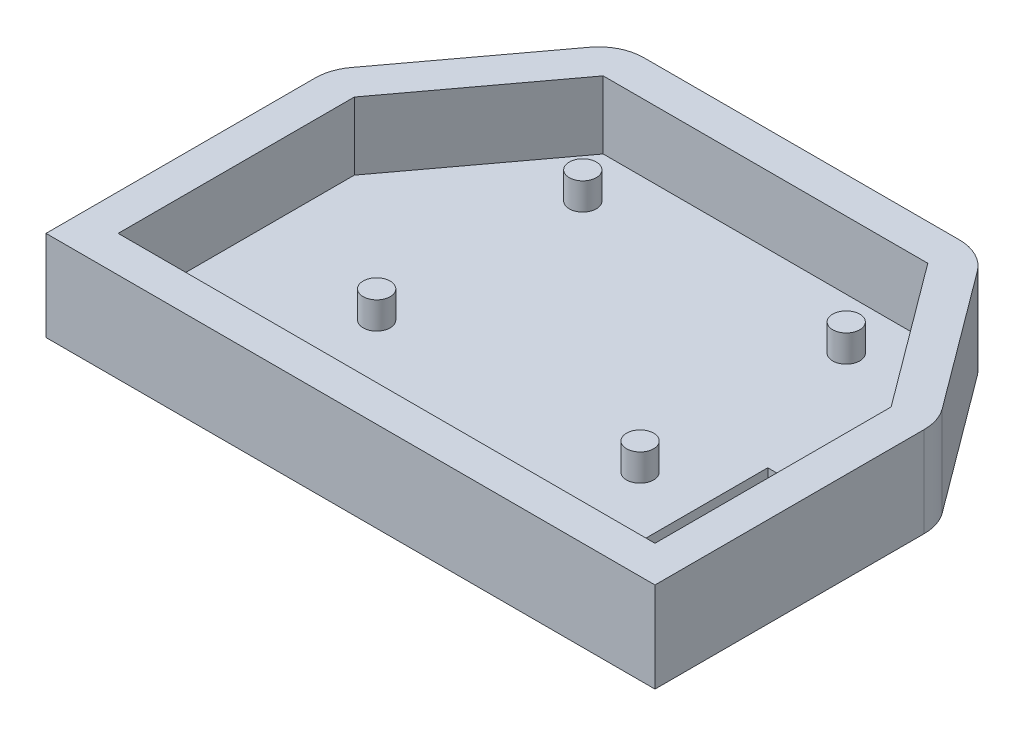
ISO-10303-21;
HEADER;
FILE_DESCRIPTION(('STEP AP214'),'2;1');
FILE_NAME('part.step','',(''),(''),'','','');
FILE_SCHEMA(('AUTOMOTIVE_DESIGN { 1 0 10303 214 1 1 1 1 }'));
ENDSEC;
DATA;
#1=APPLICATION_CONTEXT('core data for automotive mechanical design processes');
#2=APPLICATION_PROTOCOL_DEFINITION('international standard','automotive_design',2000,#1);
#3=PRODUCT_CONTEXT('',#1,'mechanical');
#4=PRODUCT('Part','Part','',(#3));
#5=PRODUCT_RELATED_PRODUCT_CATEGORY('part','',(#4));
#6=PRODUCT_DEFINITION_FORMATION('','',#4);
#7=PRODUCT_DEFINITION_CONTEXT('part definition',#1,'design');
#8=PRODUCT_DEFINITION('design','',#6,#7);
#9=PRODUCT_DEFINITION_SHAPE('','',#8);
#10=(LENGTH_UNIT() NAMED_UNIT(*) SI_UNIT(.MILLI.,.METRE.));
#11=(NAMED_UNIT(*) PLANE_ANGLE_UNIT() SI_UNIT($,.RADIAN.));
#12=(NAMED_UNIT(*) SI_UNIT($,.STERADIAN.) SOLID_ANGLE_UNIT());
#13=UNCERTAINTY_MEASURE_WITH_UNIT(LENGTH_MEASURE(1.E-05),#10,'distance_accuracy_value','');
#14=(GEOMETRIC_REPRESENTATION_CONTEXT(3) GLOBAL_UNCERTAINTY_ASSIGNED_CONTEXT((#13)) GLOBAL_UNIT_ASSIGNED_CONTEXT((#10,
#11,#12)) REPRESENTATION_CONTEXT('',''));
#15=CARTESIAN_POINT('',(0.,0.,0.));
#16=DIRECTION('',(0.,0.,1.));
#17=DIRECTION('',(1.,0.,0.));
#18=AXIS2_PLACEMENT_3D('',#15,#16,#17);
#19=CARTESIAN_POINT('',(-37.3370264976293,83.5,-23.1323962318236));
#20=DIRECTION('',(0.,-1.,0.));
#21=DIRECTION('',(-1.,0.,0.));
#22=AXIS2_PLACEMENT_3D('',#19,#20,#21);
#23=CYLINDRICAL_SURFACE('',#22,10.0000000000001);
#24=DIRECTION('',(0.,-1.,0.));
#25=VECTOR('',#24,1.);
#26=CARTESIAN_POINT('',(-29.3110716594445,83.5,-29.0976329358799));
#27=LINE('',#26,#25);
#28=CARTESIAN_POINT('',(-29.3110716594445,83.5,-29.0976329358799));
#29=VERTEX_POINT('',#28);
#30=CARTESIAN_POINT('',(-29.3110716594446,63.5,-29.0976329358799));
#31=VERTEX_POINT('',#30);
#32=EDGE_CURVE('E313',#29,#31,#27,.T.);
#33=ORIENTED_EDGE('',*,*,#32,.T.);
#34=CARTESIAN_POINT('',(-37.3370264976293,63.5,-23.1323962318236));
#35=DIRECTION('',(0.,1.,0.));
#36=DIRECTION('',(-1.,0.,0.));
#37=AXIS2_PLACEMENT_3D('',#34,#35,#36);
#38=CIRCLE('',#37,10.0000000000001);
#39=CARTESIAN_POINT('',(-37.3370264976293,63.5,-33.1323962318237));
#40=VERTEX_POINT('',#39);
#41=EDGE_CURVE('E235',#31,#40,#38,.T.);
#42=ORIENTED_EDGE('',*,*,#41,.T.);
#43=DIRECTION('',(0.,-1.,0.));
#44=VECTOR('',#43,1.);
#45=CARTESIAN_POINT('',(-37.3370264976293,83.5,-33.1323962318237));
#46=LINE('',#45,#44);
#47=CARTESIAN_POINT('',(-37.3370264976293,83.5,-33.1323962318237));
#48=VERTEX_POINT('',#47);
#49=EDGE_CURVE('E11',#48,#40,#46,.T.);
#50=ORIENTED_EDGE('',*,*,#49,.F.);
#51=CARTESIAN_POINT('',(-37.3370264976293,83.5,-23.1323962318236));
#52=DIRECTION('',(0.,1.,0.));
#53=DIRECTION('',(1.,0.,0.));
#54=AXIS2_PLACEMENT_3D('',#51,#52,#53);
#55=CIRCLE('',#54,10.0000000000001);
#56=EDGE_CURVE('E278',#29,#48,#55,.T.);
#57=ORIENTED_EDGE('',*,*,#56,.F.);
#58=EDGE_LOOP('',(#33,#42,#50,#57));
#59=FACE_BOUND('',#58,.T.);
#60=ADVANCED_FACE('F41',(#59),#23,.T.);
#61=CARTESIAN_POINT('',(0.,83.5,-33.1323962318237));
#62=DIRECTION('',(0.,0.,1.));
#63=DIRECTION('',(0.,-1.,0.));
#64=AXIS2_PLACEMENT_3D('',#61,#62,#63);
#65=PLANE('',#64);
#66=ORIENTED_EDGE('',*,*,#49,.T.);
#67=DIRECTION('',(-1.,0.,0.));
#68=VECTOR('',#67,1.);
#69=CARTESIAN_POINT('',(-107.282737936852,63.5,-33.1323962318237));
#70=LINE('',#69,#68);
#71=CARTESIAN_POINT('',(-107.282737936852,63.5,-33.1323962318237));
#72=VERTEX_POINT('',#71);
#73=EDGE_CURVE('E238',#40,#72,#70,.T.);
#74=ORIENTED_EDGE('',*,*,#73,.T.);
#75=DIRECTION('',(0.,-1.,0.));
#76=VECTOR('',#75,1.);
#77=CARTESIAN_POINT('',(-107.282737936852,83.5,-33.1323962318237));
#78=LINE('',#77,#76);
#79=CARTESIAN_POINT('',(-107.282737936852,83.5,-33.1323962318237));
#80=VERTEX_POINT('',#79);
#81=EDGE_CURVE('E51',#80,#72,#78,.T.);
#82=ORIENTED_EDGE('',*,*,#81,.F.);
#83=DIRECTION('',(-1.,0.,0.));
#84=VECTOR('',#83,1.);
#85=CARTESIAN_POINT('',(0.,83.5,-33.1323962318237));
#86=LINE('',#85,#84);
#87=EDGE_CURVE('E280',#48,#80,#86,.T.);
#88=ORIENTED_EDGE('',*,*,#87,.F.);
#89=EDGE_LOOP('',(#66,#74,#82,#88));
#90=FACE_BOUND('',#89,.T.);
#91=ADVANCED_FACE('F379',(#90),#65,.F.);
#92=CARTESIAN_POINT('',(-107.282737936852,83.5,-23.1323962318235));
#93=DIRECTION('',(0.,-1.,0.));
#94=DIRECTION('',(-1.,0.,0.));
#95=AXIS2_PLACEMENT_3D('',#92,#93,#94);
#96=CYLINDRICAL_SURFACE('',#95,10.0000000000002);
#97=ORIENTED_EDGE('',*,*,#81,.T.);
#98=CARTESIAN_POINT('',(-107.282737936852,63.5,-23.1323962318235));
#99=DIRECTION('',(0.,1.,0.));
#100=DIRECTION('',(-1.,0.,0.));
#101=AXIS2_PLACEMENT_3D('',#98,#99,#100);
#102=CIRCLE('',#101,10.0000000000002);
#103=CARTESIAN_POINT('',(-115.308692775037,63.5,-29.0976329358799));
#104=VERTEX_POINT('',#103);
#105=EDGE_CURVE('E241',#72,#104,#102,.T.);
#106=ORIENTED_EDGE('',*,*,#105,.T.);
#107=DIRECTION('',(0.,-1.,0.));
#108=VECTOR('',#107,1.);
#109=CARTESIAN_POINT('',(-115.308692775037,83.5,-29.0976329358799));
#110=LINE('',#109,#108);
#111=CARTESIAN_POINT('',(-115.308692775037,83.5,-29.0976329358799));
#112=VERTEX_POINT('',#111);
#113=EDGE_CURVE('E327',#112,#104,#110,.T.);
#114=ORIENTED_EDGE('',*,*,#113,.F.);
#115=CARTESIAN_POINT('',(-107.282737936852,83.5,-23.1323962318235));
#116=DIRECTION('',(0.,1.,0.));
#117=DIRECTION('',(1.,0.,0.));
#118=AXIS2_PLACEMENT_3D('',#115,#116,#117);
#119=CIRCLE('',#118,10.0000000000002);
#120=EDGE_CURVE('E282',#80,#112,#119,.T.);
#121=ORIENTED_EDGE('',*,*,#120,.F.);
#122=EDGE_LOOP('',(#97,#106,#114,#121));
#123=FACE_BOUND('',#122,.T.);
#124=ADVANCED_FACE('F384',(#123),#96,.T.);
#125=CARTESIAN_POINT('',(-88.2081834707837,83.5,-65.5601363634203));
#126=DIRECTION('',(0.802595483818471,0.,0.596523670405621));
#127=DIRECTION('',(0.596523670405621,0.,-0.802595483818471));
#128=AXIS2_PLACEMENT_3D('',#125,#126,#127);
#129=PLANE('',#128);
#130=ORIENTED_EDGE('',*,*,#113,.T.);
#131=DIRECTION('',(-0.596523670405621,0.,0.802595483818471));
#132=VECTOR('',#131,1.);
#133=CARTESIAN_POINT('',(-115.308692775037,63.5,-29.0976329358799));
#134=LINE('',#133,#132);
#135=CARTESIAN_POINT('',(-137.835837055425,63.5,1.21161573227939));
#136=VERTEX_POINT('',#135);
#137=EDGE_CURVE('E244',#104,#136,#134,.T.);
#138=ORIENTED_EDGE('',*,*,#137,.T.);
#139=DIRECTION('',(0.,-1.,0.));
#140=VECTOR('',#139,1.);
#141=CARTESIAN_POINT('',(-137.835837055425,83.5,1.21161573227939));
#142=LINE('',#141,#140);
#143=CARTESIAN_POINT('',(-137.835837055425,83.5,1.21161573227939));
#144=VERTEX_POINT('',#143);
#145=EDGE_CURVE('E325',#144,#136,#142,.T.);
#146=ORIENTED_EDGE('',*,*,#145,.F.);
#147=DIRECTION('',(-0.596523670405621,0.,0.802595483818471));
#148=VECTOR('',#147,1.);
#149=CARTESIAN_POINT('',(-88.2081834707837,83.5,-65.5601363634203));
#150=LINE('',#149,#148);
#151=EDGE_CURVE('E284',#112,#144,#150,.T.);
#152=ORIENTED_EDGE('',*,*,#151,.F.);
#153=EDGE_LOOP('',(#130,#138,#146,#152));
#154=FACE_BOUND('',#153,.T.);
#155=ADVANCED_FACE('F390',(#154),#129,.F.);
#156=CARTESIAN_POINT('',(-129.80988221724,83.5,7.17685243633568));
#157=DIRECTION('',(0.,-1.,0.));
#158=DIRECTION('',(-1.,0.,0.));
#159=AXIS2_PLACEMENT_3D('',#156,#157,#158);
#160=CYLINDRICAL_SURFACE('',#159,10.0000000000003);
#161=ORIENTED_EDGE('',*,*,#145,.T.);
#162=CARTESIAN_POINT('',(-129.80988221724,63.5,7.17685243633568));
#163=DIRECTION('',(0.,1.,0.));
#164=DIRECTION('',(-1.,0.,0.));
#165=AXIS2_PLACEMENT_3D('',#162,#163,#164);
#166=CIRCLE('',#165,10.0000000000003);
#167=CARTESIAN_POINT('',(-139.809882217241,63.5,7.17685243633561));
#168=VERTEX_POINT('',#167);
#169=EDGE_CURVE('E247',#136,#168,#166,.T.);
#170=ORIENTED_EDGE('',*,*,#169,.T.);
#171=DIRECTION('',(0.,-1.,0.));
#172=VECTOR('',#171,1.);
#173=CARTESIAN_POINT('',(-139.809882217241,83.5,7.17685243633561));
#174=LINE('',#173,#172);
#175=CARTESIAN_POINT('',(-139.809882217241,83.5,7.17685243633561));
#176=VERTEX_POINT('',#175);
#177=EDGE_CURVE('E323',#176,#168,#174,.T.);
#178=ORIENTED_EDGE('',*,*,#177,.F.);
#179=CARTESIAN_POINT('',(-129.80988221724,83.5,7.17685243633568));
#180=DIRECTION('',(0.,1.,0.));
#181=DIRECTION('',(1.,0.,0.));
#182=AXIS2_PLACEMENT_3D('',#179,#180,#181);
#183=CIRCLE('',#182,10.0000000000003);
#184=EDGE_CURVE('E286',#144,#176,#183,.T.);
#185=ORIENTED_EDGE('',*,*,#184,.F.);
#186=EDGE_LOOP('',(#161,#170,#178,#185));
#187=FACE_BOUND('',#186,.T.);
#188=ADVANCED_FACE('F394',(#187),#160,.T.);
#189=CARTESIAN_POINT('',(-139.809882217241,83.5,0.));
#190=DIRECTION('',(1.,0.,0.));
#191=DIRECTION('',(0.,0.,-1.));
#192=AXIS2_PLACEMENT_3D('',#189,#190,#191);
#193=PLANE('',#192);
#194=ORIENTED_EDGE('',*,*,#177,.T.);
#195=DIRECTION('',(0.,0.,1.));
#196=VECTOR('',#195,1.);
#197=CARTESIAN_POINT('',(-139.809882217241,63.5,66.8676037681763));
#198=LINE('',#197,#196);
#199=CARTESIAN_POINT('',(-139.809882217241,63.5,66.8676037681763));
#200=VERTEX_POINT('',#199);
#201=EDGE_CURVE('E194',#168,#200,#198,.T.);
#202=ORIENTED_EDGE('',*,*,#201,.T.);
#203=DIRECTION('',(0.,-1.,0.));
#204=VECTOR('',#203,1.);
#205=CARTESIAN_POINT('',(-139.809882217241,83.5,66.8676037681763));
#206=LINE('',#205,#204);
#207=CARTESIAN_POINT('',(-139.809882217241,83.5,66.8676037681763));
#208=VERTEX_POINT('',#207);
#209=EDGE_CURVE('E321',#208,#200,#206,.T.);
#210=ORIENTED_EDGE('',*,*,#209,.F.);
#211=DIRECTION('',(0.,0.,1.));
#212=VECTOR('',#211,1.);
#213=CARTESIAN_POINT('',(-139.809882217241,83.5,0.));
#214=LINE('',#213,#212);
#215=EDGE_CURVE('E288',#176,#208,#214,.T.);
#216=ORIENTED_EDGE('',*,*,#215,.F.);
#217=EDGE_LOOP('',(#194,#202,#210,#216));
#218=FACE_BOUND('',#217,.T.);
#219=ADVANCED_FACE('F399',(#218),#193,.F.);
#220=CARTESIAN_POINT('',(0.,83.5,66.8676037681763));
#221=DIRECTION('',(0.,0.,-1.));
#222=DIRECTION('',(-1.,0.,0.));
#223=AXIS2_PLACEMENT_3D('',#220,#221,#222);
#224=PLANE('',#223);
#225=ORIENTED_EDGE('',*,*,#209,.T.);
#226=DIRECTION('',(1.,0.,0.));
#227=VECTOR('',#226,1.);
#228=CARTESIAN_POINT('',(-139.809882217241,63.5,66.8676037681763));
#229=LINE('',#228,#227);
#230=CARTESIAN_POINT('',(-4.8098822172406,63.5,66.8676037681763));
#231=VERTEX_POINT('',#230);
#232=EDGE_CURVE('E223',#200,#231,#229,.T.);
#233=ORIENTED_EDGE('',*,*,#232,.T.);
#234=DIRECTION('',(0.,-1.,0.));
#235=VECTOR('',#234,1.);
#236=CARTESIAN_POINT('',(-4.8098822172406,83.5,66.8676037681763));
#237=LINE('',#236,#235);
#238=CARTESIAN_POINT('',(-4.8098822172406,83.5,66.8676037681763));
#239=VERTEX_POINT('',#238);
#240=EDGE_CURVE('E319',#239,#231,#237,.T.);
#241=ORIENTED_EDGE('',*,*,#240,.F.);
#242=DIRECTION('',(1.,0.,0.));
#243=VECTOR('',#242,1.);
#244=CARTESIAN_POINT('',(0.,83.5,66.8676037681763));
#245=LINE('',#244,#243);
#246=EDGE_CURVE('E290',#208,#239,#245,.T.);
#247=ORIENTED_EDGE('',*,*,#246,.F.);
#248=EDGE_LOOP('',(#225,#233,#241,#247));
#249=FACE_BOUND('',#248,.T.);
#250=ADVANCED_FACE('F405',(#249),#224,.F.);
#251=CARTESIAN_POINT('',(-4.8098822172406,83.5,0.));
#252=DIRECTION('',(-1.,0.,0.));
#253=DIRECTION('',(0.,1.,0.));
#254=AXIS2_PLACEMENT_3D('',#251,#252,#253);
#255=PLANE('',#254);
#256=ORIENTED_EDGE('',*,*,#240,.T.);
#257=DIRECTION('',(0.,0.,-1.));
#258=VECTOR('',#257,1.);
#259=CARTESIAN_POINT('',(-4.8098822172406,63.5,66.8676037681763));
#260=LINE('',#259,#258);
#261=CARTESIAN_POINT('',(-4.8098822172406,63.5,7.1768524363356));
#262=VERTEX_POINT('',#261);
#263=EDGE_CURVE('E226',#231,#262,#260,.T.);
#264=ORIENTED_EDGE('',*,*,#263,.T.);
#265=DIRECTION('',(0.,-1.,0.));
#266=VECTOR('',#265,1.);
#267=CARTESIAN_POINT('',(-4.8098822172406,83.5,7.17685243633558));
#268=LINE('',#267,#266);
#269=CARTESIAN_POINT('',(-4.8098822172406,83.5,7.17685243633558));
#270=VERTEX_POINT('',#269);
#271=EDGE_CURVE('E317',#270,#262,#268,.T.);
#272=ORIENTED_EDGE('',*,*,#271,.F.);
#273=DIRECTION('',(0.,0.,-1.));
#274=VECTOR('',#273,1.);
#275=CARTESIAN_POINT('',(-4.8098822172406,83.5,0.));
#276=LINE('',#275,#274);
#277=EDGE_CURVE('E292',#239,#270,#276,.T.);
#278=ORIENTED_EDGE('',*,*,#277,.F.);
#279=EDGE_LOOP('',(#256,#264,#272,#278));
#280=FACE_BOUND('',#279,.T.);
#281=ADVANCED_FACE('F409',(#280),#255,.F.);
#282=CARTESIAN_POINT('',(-14.8098822172407,83.5,7.17685243633558));
#283=DIRECTION('',(0.,-1.,0.));
#284=DIRECTION('',(-1.,0.,0.));
#285=AXIS2_PLACEMENT_3D('',#282,#283,#284);
#286=CYLINDRICAL_SURFACE('',#285,10.0000000000001);
#287=ORIENTED_EDGE('',*,*,#271,.T.);
#288=CARTESIAN_POINT('',(-14.8098822172407,63.5,7.17685243633558));
#289=DIRECTION('',(0.,1.,0.));
#290=DIRECTION('',(1.,0.,0.));
#291=AXIS2_PLACEMENT_3D('',#288,#289,#290);
#292=CIRCLE('',#291,10.0000000000001);
#293=CARTESIAN_POINT('',(-6.78392737905587,63.5,1.21161573227937));
#294=VERTEX_POINT('',#293);
#295=EDGE_CURVE('E229',#262,#294,#292,.T.);
#296=ORIENTED_EDGE('',*,*,#295,.T.);
#297=DIRECTION('',(0.,-1.,0.));
#298=VECTOR('',#297,1.);
#299=CARTESIAN_POINT('',(-6.78392737905587,83.5,1.21161573227937));
#300=LINE('',#299,#298);
#301=CARTESIAN_POINT('',(-6.78392737905587,83.5,1.21161573227937));
#302=VERTEX_POINT('',#301);
#303=EDGE_CURVE('E315',#302,#294,#300,.T.);
#304=ORIENTED_EDGE('',*,*,#303,.F.);
#305=CARTESIAN_POINT('',(-14.8098822172407,83.5,7.17685243633558));
#306=DIRECTION('',(0.,1.,0.));
#307=DIRECTION('',(1.,0.,0.));
#308=AXIS2_PLACEMENT_3D('',#305,#306,#307);
#309=CIRCLE('',#308,10.0000000000001);
#310=EDGE_CURVE('E294',#270,#302,#309,.T.);
#311=ORIENTED_EDGE('',*,*,#310,.F.);
#312=EDGE_LOOP('',(#287,#296,#304,#311));
#313=FACE_BOUND('',#312,.T.);
#314=ADVANCED_FACE('F414',(#313),#286,.T.);
#315=CARTESIAN_POINT('',(0.,83.5,-25.1323962318237));
#316=DIRECTION('',(0.,0.,-1.));
#317=DIRECTION('',(-1.,0.,0.));
#318=AXIS2_PLACEMENT_3D('',#315,#316,#317);
#319=PLANE('',#318);
#320=DIRECTION('',(1.,0.,0.));
#321=VECTOR('',#320,1.);
#322=CARTESIAN_POINT('',(0.,68.5,-25.1323962318237));
#323=LINE('',#322,#321);
#324=CARTESIAN_POINT('',(-108.28816679293,68.5,-25.1323962318237));
#325=VERTEX_POINT('',#324);
#326=CARTESIAN_POINT('',(-36.3315976415515,68.5,-25.1323962318237));
#327=VERTEX_POINT('',#326);
#328=EDGE_CURVE('E262',#325,#327,#323,.T.);
#329=ORIENTED_EDGE('',*,*,#328,.T.);
#330=DIRECTION('',(0.,-1.,0.));
#331=VECTOR('',#330,1.);
#332=CARTESIAN_POINT('',(-36.3315976415515,83.5,-25.1323962318237));
#333=LINE('',#332,#331);
#334=CARTESIAN_POINT('',(-36.3315976415515,83.5,-25.1323962318237));
#335=VERTEX_POINT('',#334);
#336=EDGE_CURVE('E45',#335,#327,#333,.T.);
#337=ORIENTED_EDGE('',*,*,#336,.F.);
#338=DIRECTION('',(1.,0.,0.));
#339=VECTOR('',#338,1.);
#340=CARTESIAN_POINT('',(0.,83.5,-25.1323962318237));
#341=LINE('',#340,#339);
#342=CARTESIAN_POINT('',(-108.28816679293,83.5,-25.1323962318237));
#343=VERTEX_POINT('',#342);
#344=EDGE_CURVE('E263',#343,#335,#341,.T.);
#345=ORIENTED_EDGE('',*,*,#344,.F.);
#346=DIRECTION('',(0.,-1.,0.));
#347=VECTOR('',#346,1.);
#348=CARTESIAN_POINT('',(-108.28816679293,83.5,-25.1323962318237));
#349=LINE('',#348,#347);
#350=EDGE_CURVE('E297',#343,#325,#349,.T.);
#351=ORIENTED_EDGE('',*,*,#350,.T.);
#352=EDGE_LOOP('',(#329,#337,#345,#351));
#353=FACE_BOUND('',#352,.T.);
#354=ADVANCED_FACE('F43',(#353),#319,.F.);
#355=CARTESIAN_POINT('',(-11.3707770875913,83.5,8.45125324077732));
#356=DIRECTION('',(0.802595483818471,0.,-0.596523670405622));
#357=DIRECTION('',(-0.596523670405622,0.,-0.802595483818471));
#358=AXIS2_PLACEMENT_3D('',#355,#356,#357);
#359=PLANE('',#358);
#360=DIRECTION('',(0.596523670405622,0.,0.802595483818471));
#361=VECTOR('',#360,1.);
#362=CARTESIAN_POINT('',(-11.3707770875913,68.5,8.45125324077732));
#363=LINE('',#362,#361);
#364=CARTESIAN_POINT('',(-12.8098822172406,68.5,6.51500270270369));
#365=VERTEX_POINT('',#364);
#366=EDGE_CURVE('E300',#327,#365,#363,.T.);
#367=ORIENTED_EDGE('',*,*,#366,.T.);
#368=DIRECTION('',(0.,-1.,0.));
#369=VECTOR('',#368,1.);
#370=CARTESIAN_POINT('',(-12.8098822172406,83.5,6.51500270270369));
#371=LINE('',#370,#369);
#372=CARTESIAN_POINT('',(-12.8098822172406,83.5,6.51500270270369));
#373=VERTEX_POINT('',#372);
#374=EDGE_CURVE('E340',#373,#365,#371,.T.);
#375=ORIENTED_EDGE('',*,*,#374,.F.);
#376=DIRECTION('',(0.596523670405622,0.,0.802595483818471));
#377=VECTOR('',#376,1.);
#378=CARTESIAN_POINT('',(-11.3707770875913,83.5,8.45125324077732));
#379=LINE('',#378,#377);
#380=EDGE_CURVE('E266',#335,#373,#379,.T.);
#381=ORIENTED_EDGE('',*,*,#380,.F.);
#382=ORIENTED_EDGE('',*,*,#336,.T.);
#383=EDGE_LOOP('',(#367,#375,#381,#382));
#384=FACE_BOUND('',#383,.T.);
#385=ADVANCED_FACE('F348',(#384),#359,.F.);
#386=CARTESIAN_POINT('',(-12.8098822172406,83.5,0.));
#387=DIRECTION('',(1.,0.,0.));
#388=DIRECTION('',(0.,0.,-1.));
#389=AXIS2_PLACEMENT_3D('',#386,#387,#388);
#390=PLANE('',#389);
#391=DIRECTION('',(0.,0.,1.));
#392=VECTOR('',#391,1.);
#393=CARTESIAN_POINT('',(-12.8098822172406,68.5,0.));
#394=LINE('',#393,#392);
#395=CARTESIAN_POINT('',(-12.8098822172406,68.5,58.8676037681763));
#396=VERTEX_POINT('',#395);
#397=EDGE_CURVE('E303',#365,#396,#394,.T.);
#398=ORIENTED_EDGE('',*,*,#397,.T.);
#399=DIRECTION('',(0.,-1.,0.));
#400=VECTOR('',#399,1.);
#401=CARTESIAN_POINT('',(-12.8098822172406,83.5,58.8676037681763));
#402=LINE('',#401,#400);
#403=CARTESIAN_POINT('',(-12.8098822172406,83.5,58.8676037681763));
#404=VERTEX_POINT('',#403);
#405=EDGE_CURVE('E338',#404,#396,#402,.T.);
#406=ORIENTED_EDGE('',*,*,#405,.F.);
#407=DIRECTION('',(0.,0.,1.));
#408=VECTOR('',#407,1.);
#409=CARTESIAN_POINT('',(-12.8098822172406,83.5,0.));
#410=LINE('',#409,#408);
#411=EDGE_CURVE('E269',#373,#404,#410,.T.);
#412=ORIENTED_EDGE('',*,*,#411,.F.);
#413=ORIENTED_EDGE('',*,*,#374,.T.);
#414=EDGE_LOOP('',(#398,#406,#412,#413));
#415=FACE_BOUND('',#414,.T.);
#416=ADVANCED_FACE('F364',(#415),#390,.F.);
#417=CARTESIAN_POINT('',(0.,83.5,58.8676037681763));
#418=DIRECTION('',(0.,0.,1.));
#419=DIRECTION('',(1.,0.,0.));
#420=AXIS2_PLACEMENT_3D('',#417,#418,#419);
#421=PLANE('',#420);
#422=DIRECTION('',(-1.,0.,0.));
#423=VECTOR('',#422,1.);
#424=CARTESIAN_POINT('',(0.,68.5,58.8676037681763));
#425=LINE('',#424,#423);
#426=CARTESIAN_POINT('',(-131.809882217241,68.5,58.8676037681763));
#427=VERTEX_POINT('',#426);
#428=EDGE_CURVE('E306',#396,#427,#425,.T.);
#429=ORIENTED_EDGE('',*,*,#428,.T.);
#430=DIRECTION('',(0.,-1.,0.));
#431=VECTOR('',#430,1.);
#432=CARTESIAN_POINT('',(-131.809882217241,83.5,58.8676037681763));
#433=LINE('',#432,#431);
#434=CARTESIAN_POINT('',(-131.809882217241,83.5,58.8676037681763));
#435=VERTEX_POINT('',#434);
#436=EDGE_CURVE('E335',#435,#427,#433,.T.);
#437=ORIENTED_EDGE('',*,*,#436,.F.);
#438=DIRECTION('',(-1.,0.,0.));
#439=VECTOR('',#438,1.);
#440=CARTESIAN_POINT('',(0.,83.5,58.8676037681763));
#441=LINE('',#440,#439);
#442=EDGE_CURVE('E271',#404,#435,#441,.T.);
#443=ORIENTED_EDGE('',*,*,#442,.F.);
#444=ORIENTED_EDGE('',*,*,#405,.T.);
#445=EDGE_LOOP('',(#429,#437,#443,#444));
#446=FACE_BOUND('',#445,.T.);
#447=ADVANCED_FACE('F366',(#446),#421,.F.);
#448=CARTESIAN_POINT('',(-131.809882217241,83.5,0.));
#449=DIRECTION('',(1.,0.,0.));
#450=DIRECTION('',(0.,-1.,0.));
#451=AXIS2_PLACEMENT_3D('',#448,#449,#450);
#452=PLANE('',#451);
#453=DIRECTION('',(0.,0.,1.));
#454=VECTOR('',#453,1.);
#455=CARTESIAN_POINT('',(-131.809882217241,68.5,0.));
#456=LINE('',#455,#454);
#457=CARTESIAN_POINT('',(-131.809882217241,68.5,6.51500270270371));
#458=VERTEX_POINT('',#457);
#459=EDGE_CURVE('E309',#458,#427,#456,.T.);
#460=ORIENTED_EDGE('',*,*,#459,.F.);
#461=DIRECTION('',(0.,-1.,0.));
#462=VECTOR('',#461,1.);
#463=CARTESIAN_POINT('',(-131.809882217241,83.5,6.51500270270371));
#464=LINE('',#463,#462);
#465=CARTESIAN_POINT('',(-131.809882217241,83.5,6.51500270270371));
#466=VERTEX_POINT('',#465);
#467=EDGE_CURVE('E332',#466,#458,#464,.T.);
#468=ORIENTED_EDGE('',*,*,#467,.F.);
#469=DIRECTION('',(0.,0.,1.));
#470=VECTOR('',#469,1.);
#471=CARTESIAN_POINT('',(-131.809882217241,83.5,0.));
#472=LINE('',#471,#470);
#473=EDGE_CURVE('E273',#466,#435,#472,.T.);
#474=ORIENTED_EDGE('',*,*,#473,.T.);
#475=ORIENTED_EDGE('',*,*,#436,.T.);
#476=EDGE_LOOP('',(#460,#468,#474,#475));
#477=FACE_BOUND('',#476,.T.);
#478=ADVANCED_FACE('F360',(#477),#452,.T.);
#479=CARTESIAN_POINT('',(-81.7874196002359,83.5,-60.7879470001754));
#480=DIRECTION('',(-0.802595483818471,0.,-0.596523670405621));
#481=DIRECTION('',(-0.596523670405621,0.,0.802595483818472));
#482=AXIS2_PLACEMENT_3D('',#479,#480,#481);
#483=PLANE('',#482);
#484=DIRECTION('',(0.596523670405621,0.,-0.802595483818471));
#485=VECTOR('',#484,1.);
#486=CARTESIAN_POINT('',(-81.7874196002359,68.5,-60.7879470001754));
#487=LINE('',#486,#485);
#488=EDGE_CURVE('E267',#458,#325,#487,.T.);
#489=ORIENTED_EDGE('',*,*,#488,.T.);
#490=ORIENTED_EDGE('',*,*,#350,.F.);
#491=DIRECTION('',(0.596523670405621,0.,-0.802595483818471));
#492=VECTOR('',#491,1.);
#493=CARTESIAN_POINT('',(-81.7874196002359,83.5,-60.7879470001754));
#494=LINE('',#493,#492);
#495=EDGE_CURVE('E276',#466,#343,#494,.T.);
#496=ORIENTED_EDGE('',*,*,#495,.F.);
#497=ORIENTED_EDGE('',*,*,#467,.T.);
#498=EDGE_LOOP('',(#489,#490,#496,#497));
#499=FACE_BOUND('',#498,.T.);
#500=ADVANCED_FACE('F355',(#499),#483,.F.);
#501=CARTESIAN_POINT('',(-4.95001321704352,83.5,3.67906387753235));
#502=DIRECTION('',(-0.802595483818471,0.,0.596523670405622));
#503=DIRECTION('',(0.596523670405622,0.,0.802595483818471));
#504=AXIS2_PLACEMENT_3D('',#501,#502,#503);
#505=PLANE('',#504);
#506=ORIENTED_EDGE('',*,*,#303,.T.);
#507=DIRECTION('',(-0.596523670405621,0.,-0.802595483818471));
#508=VECTOR('',#507,1.);
#509=CARTESIAN_POINT('',(-6.78392737905587,63.5,1.21161573227937));
#510=LINE('',#509,#508);
#511=EDGE_CURVE('E232',#294,#31,#510,.T.);
#512=ORIENTED_EDGE('',*,*,#511,.T.);
#513=ORIENTED_EDGE('',*,*,#32,.F.);
#514=DIRECTION('',(-0.596523670405622,0.,-0.802595483818471));
#515=VECTOR('',#514,1.);
#516=CARTESIAN_POINT('',(-4.95001321704352,83.5,3.67906387753235));
#517=LINE('',#516,#515);
#518=EDGE_CURVE('E59',#302,#29,#517,.T.);
#519=ORIENTED_EDGE('',*,*,#518,.F.);
#520=EDGE_LOOP('',(#506,#512,#513,#519));
#521=FACE_BOUND('',#520,.T.);
#522=ADVANCED_FACE('F370',(#521),#505,.F.);
#523=CARTESIAN_POINT('',(0.,83.5,0.));
#524=DIRECTION('',(0.,1.,0.));
#525=DIRECTION('',(1.,0.,0.));
#526=AXIS2_PLACEMENT_3D('',#523,#524,#525);
#527=PLANE('',#526);
#528=ORIENTED_EDGE('',*,*,#344,.T.);
#529=ORIENTED_EDGE('',*,*,#380,.T.);
#530=ORIENTED_EDGE('',*,*,#411,.T.);
#531=ORIENTED_EDGE('',*,*,#442,.T.);
#532=ORIENTED_EDGE('',*,*,#473,.F.);
#533=ORIENTED_EDGE('',*,*,#495,.T.);
#534=EDGE_LOOP('',(#528,#529,#530,#531,#532,#533));
#535=FACE_BOUND('',#534,.T.);
#536=ORIENTED_EDGE('',*,*,#56,.T.);
#537=ORIENTED_EDGE('',*,*,#87,.T.);
#538=ORIENTED_EDGE('',*,*,#120,.T.);
#539=ORIENTED_EDGE('',*,*,#151,.T.);
#540=ORIENTED_EDGE('',*,*,#184,.T.);
#541=ORIENTED_EDGE('',*,*,#215,.T.);
#542=ORIENTED_EDGE('',*,*,#246,.T.);
#543=ORIENTED_EDGE('',*,*,#277,.T.);
#544=ORIENTED_EDGE('',*,*,#310,.T.);
#545=ORIENTED_EDGE('',*,*,#518,.T.);
#546=EDGE_LOOP('',(#536,#537,#538,#539,#540,#541,#542,#543,#544,#545));
#547=FACE_BOUND('',#546,.T.);
#548=ADVANCED_FACE('F368',(#535,#547),#527,.T.);
#549=CARTESIAN_POINT('',(-129.80988221724,68.5,7.17685243633568));
#550=DIRECTION('',(0.,-1.,0.));
#551=DIRECTION('',(-1.,0.,0.));
#552=AXIS2_PLACEMENT_3D('',#549,#550,#551);
#553=PLANE('',#552);
#554=DIRECTION('',(0.,0.,-1.));
#555=VECTOR('',#554,1.);
#556=CARTESIAN_POINT('',(-14.8098822172406,68.5,16.8676037681763));
#557=LINE('',#556,#555);
#558=CARTESIAN_POINT('',(-14.8098822172406,68.5,51.8676037681763));
#559=VERTEX_POINT('',#558);
#560=CARTESIAN_POINT('',(-14.8098822172406,68.5,16.8676037681763));
#561=VERTEX_POINT('',#560);
#562=EDGE_CURVE('E176',#559,#561,#557,.T.);
#563=ORIENTED_EDGE('',*,*,#562,.F.);
#564=DIRECTION('',(1.,0.,0.));
#565=VECTOR('',#564,1.);
#566=CARTESIAN_POINT('',(-14.8098822172406,68.5,51.8676037681763));
#567=LINE('',#566,#565);
#568=CARTESIAN_POINT('',(-29.8098822172406,68.5,51.8676037681763));
#569=VERTEX_POINT('',#568);
#570=EDGE_CURVE('E203',#569,#559,#567,.T.);
#571=ORIENTED_EDGE('',*,*,#570,.F.);
#572=DIRECTION('',(0.,0.,1.));
#573=VECTOR('',#572,1.);
#574=CARTESIAN_POINT('',(-29.8098822172406,68.5,16.8676037681763));
#575=LINE('',#574,#573);
#576=CARTESIAN_POINT('',(-29.8098822172406,68.5,16.8676037681763));
#577=VERTEX_POINT('',#576);
#578=EDGE_CURVE('E201',#577,#569,#575,.T.);
#579=ORIENTED_EDGE('',*,*,#578,.F.);
#580=DIRECTION('',(-1.,0.,0.));
#581=VECTOR('',#580,1.);
#582=CARTESIAN_POINT('',(-14.8098822172406,68.5,16.8676037681763));
#583=LINE('',#582,#581);
#584=EDGE_CURVE('E186',#561,#577,#583,.T.);
#585=ORIENTED_EDGE('',*,*,#584,.F.);
#586=EDGE_LOOP('',(#563,#571,#579,#585));
#587=FACE_BOUND('',#586,.T.);
#588=CARTESIAN_POINT('',(-101.509882217241,68.5,31.8676037681763));
#589=DIRECTION('',(0.,-1.,0.));
#590=DIRECTION('',(-1.,0.,0.));
#591=AXIS2_PLACEMENT_3D('',#588,#589,#590);
#592=CIRCLE('',#591,3.00000000000001);
#593=CARTESIAN_POINT('',(-104.509882217241,68.5,31.8676037681763));
#594=VERTEX_POINT('',#593);
#595=EDGE_CURVE('E250',#594,#594,#592,.F.);
#596=ORIENTED_EDGE('',*,*,#595,.F.);
#597=EDGE_LOOP('',(#596));
#598=FACE_BOUND('',#597,.T.);
#599=CARTESIAN_POINT('',(-101.509882217241,68.5,-13.8323962318237));
#600=DIRECTION('',(0.,-1.,0.));
#601=DIRECTION('',(-1.,0.,0.));
#602=AXIS2_PLACEMENT_3D('',#599,#600,#601);
#603=CIRCLE('',#602,3.00000000000002);
#604=CARTESIAN_POINT('',(-104.509882217241,68.5,-13.8323962318237));
#605=VERTEX_POINT('',#604);
#606=EDGE_CURVE('E253',#605,#605,#603,.F.);
#607=ORIENTED_EDGE('',*,*,#606,.F.);
#608=EDGE_LOOP('',(#607));
#609=FACE_BOUND('',#608,.T.);
#610=CARTESIAN_POINT('',(-43.1098822172406,68.5,-13.8323962318237));
#611=DIRECTION('',(0.,-1.,0.));
#612=DIRECTION('',(-1.,0.,0.));
#613=AXIS2_PLACEMENT_3D('',#610,#611,#612);
#614=CIRCLE('',#613,3.00000000000001);
#615=CARTESIAN_POINT('',(-46.1098822172406,68.5,-13.8323962318237));
#616=VERTEX_POINT('',#615);
#617=EDGE_CURVE('E256',#616,#616,#614,.F.);
#618=ORIENTED_EDGE('',*,*,#617,.F.);
#619=EDGE_LOOP('',(#618));
#620=FACE_BOUND('',#619,.T.);
#621=CARTESIAN_POINT('',(-43.1098822172406,68.5,31.8676037681763));
#622=DIRECTION('',(0.,-1.,0.));
#623=DIRECTION('',(-1.,0.,0.));
#624=AXIS2_PLACEMENT_3D('',#621,#622,#623);
#625=CIRCLE('',#624,3.);
#626=CARTESIAN_POINT('',(-46.1098822172406,68.5,31.8676037681763));
#627=VERTEX_POINT('',#626);
#628=EDGE_CURVE('E259',#627,#627,#625,.F.);
#629=ORIENTED_EDGE('',*,*,#628,.F.);
#630=EDGE_LOOP('',(#629));
#631=FACE_BOUND('',#630,.T.);
#632=ORIENTED_EDGE('',*,*,#366,.F.);
#633=ORIENTED_EDGE('',*,*,#328,.F.);
#634=ORIENTED_EDGE('',*,*,#488,.F.);
#635=ORIENTED_EDGE('',*,*,#459,.T.);
#636=ORIENTED_EDGE('',*,*,#428,.F.);
#637=ORIENTED_EDGE('',*,*,#397,.F.);
#638=EDGE_LOOP('',(#632,#633,#634,#635,#636,#637));
#639=FACE_BOUND('',#638,.T.);
#640=ADVANCED_FACE('F198',(#587,#598,#609,#620,#631,#639),#553,.F.);
#641=CARTESIAN_POINT('',(-129.80988221724,63.5,7.17685243633568));
#642=DIRECTION('',(0.,-1.,0.));
#643=DIRECTION('',(-1.,0.,0.));
#644=AXIS2_PLACEMENT_3D('',#641,#642,#643);
#645=PLANE('',#644);
#646=ORIENTED_EDGE('',*,*,#201,.F.);
#647=ORIENTED_EDGE('',*,*,#169,.F.);
#648=ORIENTED_EDGE('',*,*,#137,.F.);
#649=ORIENTED_EDGE('',*,*,#105,.F.);
#650=ORIENTED_EDGE('',*,*,#73,.F.);
#651=ORIENTED_EDGE('',*,*,#41,.F.);
#652=ORIENTED_EDGE('',*,*,#511,.F.);
#653=ORIENTED_EDGE('',*,*,#295,.F.);
#654=ORIENTED_EDGE('',*,*,#263,.F.);
#655=ORIENTED_EDGE('',*,*,#232,.F.);
#656=EDGE_LOOP('',(#646,#647,#648,#649,#650,#651,#652,#653,#654,#655));
#657=FACE_BOUND('',#656,.T.);
#658=DIRECTION('',(1.,0.,0.));
#659=VECTOR('',#658,1.);
#660=CARTESIAN_POINT('',(-14.8098822172406,63.5,51.8676037681763));
#661=LINE('',#660,#659);
#662=CARTESIAN_POINT('',(-29.8098822172406,63.5,51.8676037681763));
#663=VERTEX_POINT('',#662);
#664=CARTESIAN_POINT('',(-14.8098822172406,63.5,51.8676037681763));
#665=VERTEX_POINT('',#664);
#666=EDGE_CURVE('E187',#663,#665,#661,.T.);
#667=ORIENTED_EDGE('',*,*,#666,.T.);
#668=DIRECTION('',(0.,0.,-1.));
#669=VECTOR('',#668,1.);
#670=CARTESIAN_POINT('',(-14.8098822172406,63.5,16.8676037681763));
#671=LINE('',#670,#669);
#672=CARTESIAN_POINT('',(-14.8098822172406,63.5,16.8676037681763));
#673=VERTEX_POINT('',#672);
#674=EDGE_CURVE('E208',#665,#673,#671,.T.);
#675=ORIENTED_EDGE('',*,*,#674,.T.);
#676=DIRECTION('',(-1.,0.,0.));
#677=VECTOR('',#676,1.);
#678=CARTESIAN_POINT('',(-14.8098822172406,63.5,16.8676037681763));
#679=LINE('',#678,#677);
#680=CARTESIAN_POINT('',(-29.8098822172406,63.5,16.8676037681763));
#681=VERTEX_POINT('',#680);
#682=EDGE_CURVE('E193',#673,#681,#679,.T.);
#683=ORIENTED_EDGE('',*,*,#682,.T.);
#684=DIRECTION('',(0.,0.,1.));
#685=VECTOR('',#684,1.);
#686=CARTESIAN_POINT('',(-29.8098822172406,63.5,16.8676037681763));
#687=LINE('',#686,#685);
#688=EDGE_CURVE('E212',#681,#663,#687,.T.);
#689=ORIENTED_EDGE('',*,*,#688,.T.);
#690=EDGE_LOOP('',(#667,#675,#683,#689));
#691=FACE_BOUND('',#690,.T.);
#692=ADVANCED_FACE('F418',(#657,#691),#645,.T.);
#693=CARTESIAN_POINT('',(-14.8098822172406,68.5,16.8676037681763));
#694=DIRECTION('',(-1.,0.,0.));
#695=DIRECTION('',(0.,0.,1.));
#696=AXIS2_PLACEMENT_3D('',#693,#694,#695);
#697=PLANE('',#696);
#698=ORIENTED_EDGE('',*,*,#674,.F.);
#699=DIRECTION('',(0.,-1.,0.));
#700=VECTOR('',#699,1.);
#701=CARTESIAN_POINT('',(-14.8098822172406,68.5,51.8676037681763));
#702=LINE('',#701,#700);
#703=EDGE_CURVE('E182',#559,#665,#702,.T.);
#704=ORIENTED_EDGE('',*,*,#703,.F.);
#705=ORIENTED_EDGE('',*,*,#562,.T.);
#706=DIRECTION('',(0.,-1.,0.));
#707=VECTOR('',#706,1.);
#708=CARTESIAN_POINT('',(-14.8098822172406,68.5,16.8676037681763));
#709=LINE('',#708,#707);
#710=EDGE_CURVE('E179',#561,#673,#709,.T.);
#711=ORIENTED_EDGE('',*,*,#710,.T.);
#712=EDGE_LOOP('',(#698,#704,#705,#711));
#713=FACE_BOUND('',#712,.T.);
#714=ADVANCED_FACE('F178',(#713),#697,.T.);
#715=CARTESIAN_POINT('',(-14.8098822172406,68.5,16.8676037681763));
#716=DIRECTION('',(0.,0.,1.));
#717=DIRECTION('',(1.,0.,0.));
#718=AXIS2_PLACEMENT_3D('',#715,#716,#717);
#719=PLANE('',#718);
#720=ORIENTED_EDGE('',*,*,#682,.F.);
#721=ORIENTED_EDGE('',*,*,#710,.F.);
#722=ORIENTED_EDGE('',*,*,#584,.T.);
#723=DIRECTION('',(0.,-1.,0.));
#724=VECTOR('',#723,1.);
#725=CARTESIAN_POINT('',(-29.8098822172406,68.5,16.8676037681763));
#726=LINE('',#725,#724);
#727=EDGE_CURVE('E195',#577,#681,#726,.T.);
#728=ORIENTED_EDGE('',*,*,#727,.T.);
#729=EDGE_LOOP('',(#720,#721,#722,#728));
#730=FACE_BOUND('',#729,.T.);
#731=ADVANCED_FACE('F190',(#730),#719,.T.);
#732=CARTESIAN_POINT('',(-29.8098822172406,68.5,16.8676037681763));
#733=DIRECTION('',(1.,0.,0.));
#734=DIRECTION('',(0.,0.,-1.));
#735=AXIS2_PLACEMENT_3D('',#732,#733,#734);
#736=PLANE('',#735);
#737=ORIENTED_EDGE('',*,*,#688,.F.);
#738=ORIENTED_EDGE('',*,*,#727,.F.);
#739=ORIENTED_EDGE('',*,*,#578,.T.);
#740=DIRECTION('',(0.,-1.,0.));
#741=VECTOR('',#740,1.);
#742=CARTESIAN_POINT('',(-29.8098822172406,68.5,51.8676037681763));
#743=LINE('',#742,#741);
#744=EDGE_CURVE('E218',#569,#663,#743,.T.);
#745=ORIENTED_EDGE('',*,*,#744,.T.);
#746=EDGE_LOOP('',(#737,#738,#739,#745));
#747=FACE_BOUND('',#746,.T.);
#748=ADVANCED_FACE('F427',(#747),#736,.T.);
#749=CARTESIAN_POINT('',(-14.8098822172406,68.5,51.8676037681763));
#750=DIRECTION('',(0.,0.,-1.));
#751=DIRECTION('',(0.,1.,0.));
#752=AXIS2_PLACEMENT_3D('',#749,#750,#751);
#753=PLANE('',#752);
#754=ORIENTED_EDGE('',*,*,#666,.F.);
#755=ORIENTED_EDGE('',*,*,#744,.F.);
#756=ORIENTED_EDGE('',*,*,#570,.T.);
#757=ORIENTED_EDGE('',*,*,#703,.T.);
#758=EDGE_LOOP('',(#754,#755,#756,#757));
#759=FACE_BOUND('',#758,.T.);
#760=ADVANCED_FACE('F425',(#759),#753,.T.);
#761=CARTESIAN_POINT('',(-101.509882217241,74.5,31.8676037681763));
#762=DIRECTION('',(0.,-1.,0.));
#763=DIRECTION('',(-1.,0.,0.));
#764=AXIS2_PLACEMENT_3D('',#761,#762,#763);
#765=CYLINDRICAL_SURFACE('',#764,3.00000000000001);
#766=CARTESIAN_POINT('',(-101.509882217241,74.5,31.8676037681763));
#767=DIRECTION('',(0.,1.,0.));
#768=DIRECTION('',(1.,0.,0.));
#769=AXIS2_PLACEMENT_3D('',#766,#767,#768);
#770=CIRCLE('',#769,3.00000000000001);
#771=CARTESIAN_POINT('',(-98.5098822172406,74.5,31.8676037681763));
#772=VERTEX_POINT('',#771);
#773=EDGE_CURVE('E210',#772,#772,#770,.T.);
#774=ORIENTED_EDGE('',*,*,#773,.F.);
#775=EDGE_LOOP('',(#774));
#776=FACE_BOUND('',#775,.T.);
#777=ORIENTED_EDGE('',*,*,#595,.T.);
#778=EDGE_LOOP('',(#777));
#779=FACE_BOUND('',#778,.T.);
#780=ADVANCED_FACE('F434',(#776,#779),#765,.T.);
#781=CARTESIAN_POINT('',(-101.509882217241,74.5,31.8676037681763));
#782=DIRECTION('',(0.,1.,0.));
#783=DIRECTION('',(1.,0.,0.));
#784=AXIS2_PLACEMENT_3D('',#781,#782,#783);
#785=PLANE('',#784);
#786=ORIENTED_EDGE('',*,*,#773,.T.);
#787=EDGE_LOOP('',(#786));
#788=FACE_BOUND('',#787,.T.);
#789=ADVANCED_FACE('F628',(#788),#785,.T.);
#790=CARTESIAN_POINT('',(-101.509882217241,74.5,-13.8323962318237));
#791=DIRECTION('',(0.,-1.,0.));
#792=DIRECTION('',(-1.,0.,0.));
#793=AXIS2_PLACEMENT_3D('',#790,#791,#792);
#794=CYLINDRICAL_SURFACE('',#793,3.00000000000002);
#795=CARTESIAN_POINT('',(-101.509882217241,74.5,-13.8323962318237));
#796=DIRECTION('',(0.,1.,0.));
#797=DIRECTION('',(-1.,0.,0.));
#798=AXIS2_PLACEMENT_3D('',#795,#796,#797);
#799=CIRCLE('',#798,3.00000000000002);
#800=CARTESIAN_POINT('',(-104.509882217241,74.5,-13.8323962318237));
#801=VERTEX_POINT('',#800);
#802=EDGE_CURVE('E721',#801,#801,#799,.T.);
#803=ORIENTED_EDGE('',*,*,#802,.F.);
#804=EDGE_LOOP('',(#803));
#805=FACE_BOUND('',#804,.T.);
#806=ORIENTED_EDGE('',*,*,#606,.T.);
#807=EDGE_LOOP('',(#806));
#808=FACE_BOUND('',#807,.T.);
#809=ADVANCED_FACE('F638',(#805,#808),#794,.T.);
#810=CARTESIAN_POINT('',(-101.509882217241,74.5,-13.8323962318237));
#811=DIRECTION('',(0.,-1.,0.));
#812=DIRECTION('',(-1.,0.,0.));
#813=AXIS2_PLACEMENT_3D('',#810,#811,#812);
#814=PLANE('',#813);
#815=ORIENTED_EDGE('',*,*,#802,.T.);
#816=EDGE_LOOP('',(#815));
#817=FACE_BOUND('',#816,.T.);
#818=ADVANCED_FACE('F648',(#817),#814,.F.);
#819=CARTESIAN_POINT('',(-43.1098822172406,74.5,-13.8323962318237));
#820=DIRECTION('',(0.,-1.,0.));
#821=DIRECTION('',(-1.,0.,0.));
#822=AXIS2_PLACEMENT_3D('',#819,#820,#821);
#823=CYLINDRICAL_SURFACE('',#822,3.00000000000001);
#824=CARTESIAN_POINT('',(-43.1098822172406,74.5,-13.8323962318237));
#825=DIRECTION('',(0.,1.,0.));
#826=DIRECTION('',(1.,0.,0.));
#827=AXIS2_PLACEMENT_3D('',#824,#825,#826);
#828=CIRCLE('',#827,3.00000000000001);
#829=CARTESIAN_POINT('',(-40.1098822172406,74.5,-13.8323962318237));
#830=VERTEX_POINT('',#829);
#831=EDGE_CURVE('E718',#830,#830,#828,.T.);
#832=ORIENTED_EDGE('',*,*,#831,.F.);
#833=EDGE_LOOP('',(#832));
#834=FACE_BOUND('',#833,.T.);
#835=ORIENTED_EDGE('',*,*,#617,.T.);
#836=EDGE_LOOP('',(#835));
#837=FACE_BOUND('',#836,.T.);
#838=ADVANCED_FACE('F658',(#834,#837),#823,.T.);
#839=CARTESIAN_POINT('',(-43.1098822172406,74.5,-13.8323962318237));
#840=DIRECTION('',(0.,1.,0.));
#841=DIRECTION('',(1.,0.,0.));
#842=AXIS2_PLACEMENT_3D('',#839,#840,#841);
#843=PLANE('',#842);
#844=ORIENTED_EDGE('',*,*,#831,.T.);
#845=EDGE_LOOP('',(#844));
#846=FACE_BOUND('',#845,.T.);
#847=ADVANCED_FACE('F668',(#846),#843,.T.);
#848=CARTESIAN_POINT('',(-43.1098822172406,74.5,31.8676037681763));
#849=DIRECTION('',(0.,-1.,0.));
#850=DIRECTION('',(-1.,0.,0.));
#851=AXIS2_PLACEMENT_3D('',#848,#849,#850);
#852=CYLINDRICAL_SURFACE('',#851,3.);
#853=CARTESIAN_POINT('',(-43.1098822172406,74.5,31.8676037681763));
#854=DIRECTION('',(0.,1.,0.));
#855=DIRECTION('',(-1.,0.,0.));
#856=AXIS2_PLACEMENT_3D('',#853,#854,#855);
#857=CIRCLE('',#856,3.);
#858=CARTESIAN_POINT('',(-46.1098822172406,74.5,31.8676037681763));
#859=VERTEX_POINT('',#858);
#860=EDGE_CURVE('E717',#859,#859,#857,.T.);
#861=ORIENTED_EDGE('',*,*,#860,.F.);
#862=EDGE_LOOP('',(#861));
#863=FACE_BOUND('',#862,.T.);
#864=ORIENTED_EDGE('',*,*,#628,.T.);
#865=EDGE_LOOP('',(#864));
#866=FACE_BOUND('',#865,.T.);
#867=ADVANCED_FACE('F678',(#863,#866),#852,.T.);
#868=CARTESIAN_POINT('',(-43.1098822172406,74.5,31.8676037681763));
#869=DIRECTION('',(0.,-1.,0.));
#870=DIRECTION('',(-1.,0.,0.));
#871=AXIS2_PLACEMENT_3D('',#868,#869,#870);
#872=PLANE('',#871);
#873=ORIENTED_EDGE('',*,*,#860,.T.);
#874=EDGE_LOOP('',(#873));
#875=FACE_BOUND('',#874,.T.);
#876=ADVANCED_FACE('F688',(#875),#872,.F.);
#877=CLOSED_SHELL('',(#60,#91,#124,#155,#188,#219,#250,#281,#314,#354,#385,#416,#447,#478,#500,
#522,#548,#640,#692,#714,#731,#748,#760,#780,#789,#809,#818,#838,#847,#867,#876));
#878=MANIFOLD_SOLID_BREP('B2',#877);
#879=ADVANCED_BREP_SHAPE_REPRESENTATION('',(#18,#878),#14);
#880=SHAPE_DEFINITION_REPRESENTATION(#9,#879);
ENDSEC;
END-ISO-10303-21;
